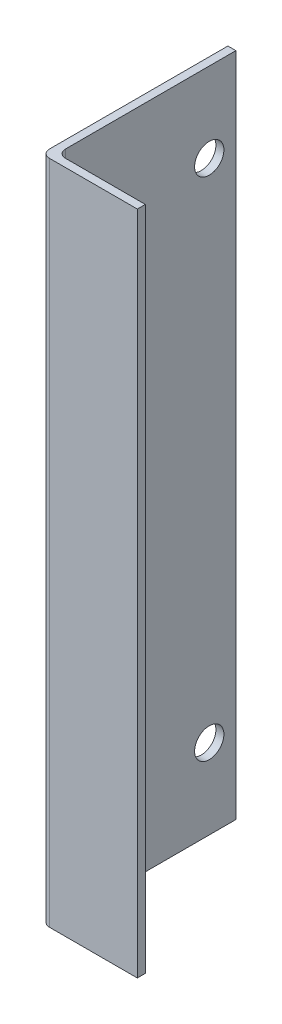
ISO-10303-21;
HEADER;
FILE_DESCRIPTION(('STEP AP214'),'2;1');
FILE_NAME('part.step','',(''),(''),'','','');
FILE_SCHEMA(('AUTOMOTIVE_DESIGN { 1 0 10303 214 1 1 1 1 }'));
ENDSEC;
DATA;
#1=APPLICATION_CONTEXT('core data for automotive mechanical design processes');
#2=APPLICATION_PROTOCOL_DEFINITION('international standard','automotive_design',2000,#1);
#3=PRODUCT_CONTEXT('',#1,'mechanical');
#4=PRODUCT('Part','Part','',(#3));
#5=PRODUCT_RELATED_PRODUCT_CATEGORY('part','',(#4));
#6=PRODUCT_DEFINITION_FORMATION('','',#4);
#7=PRODUCT_DEFINITION_CONTEXT('part definition',#1,'design');
#8=PRODUCT_DEFINITION('design','',#6,#7);
#9=PRODUCT_DEFINITION_SHAPE('','',#8);
#10=(LENGTH_UNIT() NAMED_UNIT(*) SI_UNIT(.MILLI.,.METRE.));
#11=(NAMED_UNIT(*) PLANE_ANGLE_UNIT() SI_UNIT($,.RADIAN.));
#12=(NAMED_UNIT(*) SI_UNIT($,.STERADIAN.) SOLID_ANGLE_UNIT());
#13=UNCERTAINTY_MEASURE_WITH_UNIT(LENGTH_MEASURE(1.E-05),#10,'distance_accuracy_value','');
#14=(GEOMETRIC_REPRESENTATION_CONTEXT(3) GLOBAL_UNCERTAINTY_ASSIGNED_CONTEXT((#13)) GLOBAL_UNIT_ASSIGNED_CONTEXT((#10,
#11,#12)) REPRESENTATION_CONTEXT('',''));
#15=CARTESIAN_POINT('',(0.,0.,0.));
#16=DIRECTION('',(0.,0.,1.));
#17=DIRECTION('',(1.,0.,0.));
#18=AXIS2_PLACEMENT_3D('',#15,#16,#17);
#19=CARTESIAN_POINT('',(0.,125.,0.));
#20=DIRECTION('',(0.,0.,-1.));
#21=DIRECTION('',(-1.,0.,0.));
#22=AXIS2_PLACEMENT_3D('',#19,#20,#21);
#23=PLANE('',#22);
#24=DIRECTION('',(1.,0.,0.));
#25=VECTOR('',#24,1.);
#26=CARTESIAN_POINT('',(0.,125.,0.));
#27=LINE('',#26,#25);
#28=CARTESIAN_POINT('',(1.5,125.,0.));
#29=VERTEX_POINT('',#28);
#30=CARTESIAN_POINT('',(18.,125.,0.));
#31=VERTEX_POINT('',#30);
#32=EDGE_CURVE('E104',#29,#31,#27,.T.);
#33=ORIENTED_EDGE('',*,*,#32,.F.);
#34=DIRECTION('',(0.,-1.,0.));
#35=VECTOR('',#34,1.);
#36=CARTESIAN_POINT('',(1.5,125.,0.));
#37=LINE('',#36,#35);
#38=CARTESIAN_POINT('',(1.5,0.,0.));
#39=VERTEX_POINT('',#38);
#40=EDGE_CURVE('E150',#29,#39,#37,.T.);
#41=ORIENTED_EDGE('',*,*,#40,.T.);
#42=DIRECTION('',(1.,0.,0.));
#43=VECTOR('',#42,1.);
#44=CARTESIAN_POINT('',(0.,0.,0.));
#45=LINE('',#44,#43);
#46=CARTESIAN_POINT('',(18.,0.,0.));
#47=VERTEX_POINT('',#46);
#48=EDGE_CURVE('E128',#39,#47,#45,.T.);
#49=ORIENTED_EDGE('',*,*,#48,.T.);
#50=DIRECTION('',(0.,-1.,0.));
#51=VECTOR('',#50,1.);
#52=CARTESIAN_POINT('',(18.,125.,0.));
#53=LINE('',#52,#51);
#54=EDGE_CURVE('E121',#31,#47,#53,.T.);
#55=ORIENTED_EDGE('',*,*,#54,.F.);
#56=EDGE_LOOP('',(#33,#41,#49,#55));
#57=FACE_BOUND('',#56,.T.);
#58=ADVANCED_FACE('F39',(#57),#23,.F.);
#59=CARTESIAN_POINT('',(18.,125.,-1.5));
#60=DIRECTION('',(-1.,0.,0.));
#61=DIRECTION('',(0.,0.,1.));
#62=AXIS2_PLACEMENT_3D('',#59,#60,#61);
#63=PLANE('',#62);
#64=DIRECTION('',(0.,0.,-1.));
#65=VECTOR('',#64,1.);
#66=CARTESIAN_POINT('',(18.,0.,-1.5));
#67=LINE('',#66,#65);
#68=CARTESIAN_POINT('',(18.,0.,-1.5));
#69=VERTEX_POINT('',#68);
#70=EDGE_CURVE('E158',#47,#69,#67,.T.);
#71=ORIENTED_EDGE('',*,*,#70,.T.);
#72=DIRECTION('',(0.,-1.,0.));
#73=VECTOR('',#72,1.);
#74=CARTESIAN_POINT('',(18.,125.,-1.5));
#75=LINE('',#74,#73);
#76=CARTESIAN_POINT('',(18.,125.,-1.5));
#77=VERTEX_POINT('',#76);
#78=EDGE_CURVE('E123',#77,#69,#75,.T.);
#79=ORIENTED_EDGE('',*,*,#78,.F.);
#80=DIRECTION('',(0.,0.,-1.));
#81=VECTOR('',#80,1.);
#82=CARTESIAN_POINT('',(18.,125.,-1.5));
#83=LINE('',#82,#81);
#84=EDGE_CURVE('E108',#31,#77,#83,.T.);
#85=ORIENTED_EDGE('',*,*,#84,.F.);
#86=ORIENTED_EDGE('',*,*,#54,.T.);
#87=EDGE_LOOP('',(#71,#79,#85,#86));
#88=FACE_BOUND('',#87,.T.);
#89=ADVANCED_FACE('F120',(#88),#63,.F.);
#90=CARTESIAN_POINT('',(1.5,125.,-1.5));
#91=DIRECTION('',(0.,0.,1.));
#92=DIRECTION('',(1.,0.,0.));
#93=AXIS2_PLACEMENT_3D('',#90,#91,#92);
#94=PLANE('',#93);
#95=DIRECTION('',(-1.,0.,0.));
#96=VECTOR('',#95,1.);
#97=CARTESIAN_POINT('',(1.5,0.,-1.5));
#98=LINE('',#97,#96);
#99=CARTESIAN_POINT('',(3.,0.,-1.5));
#100=VERTEX_POINT('',#99);
#101=EDGE_CURVE('E164',#69,#100,#98,.T.);
#102=ORIENTED_EDGE('',*,*,#101,.T.);
#103=DIRECTION('',(0.,-1.,0.));
#104=VECTOR('',#103,1.);
#105=CARTESIAN_POINT('',(3.,125.,-1.5));
#106=LINE('',#105,#104);
#107=CARTESIAN_POINT('',(3.,125.,-1.5));
#108=VERTEX_POINT('',#107);
#109=EDGE_CURVE('E136',#100,#108,#106,.F.);
#110=ORIENTED_EDGE('',*,*,#109,.T.);
#111=DIRECTION('',(-1.,0.,0.));
#112=VECTOR('',#111,1.);
#113=CARTESIAN_POINT('',(1.5,125.,-1.5));
#114=LINE('',#113,#112);
#115=EDGE_CURVE('E126',#77,#108,#114,.T.);
#116=ORIENTED_EDGE('',*,*,#115,.F.);
#117=ORIENTED_EDGE('',*,*,#78,.T.);
#118=EDGE_LOOP('',(#102,#110,#116,#117));
#119=FACE_BOUND('',#118,.T.);
#120=ADVANCED_FACE('F216',(#119),#94,.F.);
#121=CARTESIAN_POINT('',(1.5,125.,-35.));
#122=DIRECTION('',(-1.,0.,0.));
#123=DIRECTION('',(0.,0.,1.));
#124=AXIS2_PLACEMENT_3D('',#121,#122,#123);
#125=PLANE('',#124);
#126=CARTESIAN_POINT('',(1.5,110.,-30.));
#127=DIRECTION('',(1.,0.,0.));
#128=DIRECTION('',(0.,0.,-1.));
#129=AXIS2_PLACEMENT_3D('',#126,#127,#128);
#130=CIRCLE('',#129,2.75);
#131=CARTESIAN_POINT('',(1.5,110.,-32.75));
#132=VERTEX_POINT('',#131);
#133=EDGE_CURVE('E167',#132,#132,#130,.T.);
#134=ORIENTED_EDGE('',*,*,#133,.F.);
#135=EDGE_LOOP('',(#134));
#136=FACE_BOUND('',#135,.T.);
#137=CARTESIAN_POINT('',(1.5,15.,-30.));
#138=DIRECTION('',(1.,0.,0.));
#139=DIRECTION('',(0.,0.,-1.));
#140=AXIS2_PLACEMENT_3D('',#137,#138,#139);
#141=CIRCLE('',#140,2.75);
#142=CARTESIAN_POINT('',(1.5,15.,-32.75));
#143=VERTEX_POINT('',#142);
#144=EDGE_CURVE('E248',#143,#143,#141,.T.);
#145=ORIENTED_EDGE('',*,*,#144,.F.);
#146=EDGE_LOOP('',(#145));
#147=FACE_BOUND('',#146,.T.);
#148=DIRECTION('',(0.,0.,-1.));
#149=VECTOR('',#148,1.);
#150=CARTESIAN_POINT('',(1.5,125.,-35.));
#151=LINE('',#150,#149);
#152=CARTESIAN_POINT('',(1.5,125.,-3.));
#153=VERTEX_POINT('',#152);
#154=CARTESIAN_POINT('',(1.5,125.,-35.));
#155=VERTEX_POINT('',#154);
#156=EDGE_CURVE('E256',#153,#155,#151,.T.);
#157=ORIENTED_EDGE('',*,*,#156,.F.);
#158=DIRECTION('',(0.,-1.,0.));
#159=VECTOR('',#158,1.);
#160=CARTESIAN_POINT('',(1.5,0.,-3.));
#161=LINE('',#160,#159);
#162=CARTESIAN_POINT('',(1.5,0.,-3.));
#163=VERTEX_POINT('',#162);
#164=EDGE_CURVE('E131',#153,#163,#161,.T.);
#165=ORIENTED_EDGE('',*,*,#164,.T.);
#166=DIRECTION('',(0.,0.,-1.));
#167=VECTOR('',#166,1.);
#168=CARTESIAN_POINT('',(1.5,0.,-35.));
#169=LINE('',#168,#167);
#170=CARTESIAN_POINT('',(1.5,0.,-35.));
#171=VERTEX_POINT('',#170);
#172=EDGE_CURVE('E176',#163,#171,#169,.T.);
#173=ORIENTED_EDGE('',*,*,#172,.T.);
#174=DIRECTION('',(0.,-1.,0.));
#175=VECTOR('',#174,1.);
#176=CARTESIAN_POINT('',(1.5,125.,-35.));
#177=LINE('',#176,#175);
#178=EDGE_CURVE('E138',#155,#171,#177,.T.);
#179=ORIENTED_EDGE('',*,*,#178,.F.);
#180=EDGE_LOOP('',(#157,#165,#173,#179));
#181=FACE_BOUND('',#180,.T.);
#182=ADVANCED_FACE('F221',(#136,#147,#181),#125,.F.);
#183=CARTESIAN_POINT('',(0.,125.,-35.));
#184=DIRECTION('',(0.,0.,1.));
#185=DIRECTION('',(1.,0.,0.));
#186=AXIS2_PLACEMENT_3D('',#183,#184,#185);
#187=PLANE('',#186);
#188=DIRECTION('',(-1.,0.,0.));
#189=VECTOR('',#188,1.);
#190=CARTESIAN_POINT('',(0.,0.,-35.));
#191=LINE('',#190,#189);
#192=CARTESIAN_POINT('',(0.,0.,-35.));
#193=VERTEX_POINT('',#192);
#194=EDGE_CURVE('E179',#171,#193,#191,.T.);
#195=ORIENTED_EDGE('',*,*,#194,.T.);
#196=DIRECTION('',(0.,-1.,0.));
#197=VECTOR('',#196,1.);
#198=CARTESIAN_POINT('',(0.,125.,-35.));
#199=LINE('',#198,#197);
#200=CARTESIAN_POINT('',(0.,125.,-35.));
#201=VERTEX_POINT('',#200);
#202=EDGE_CURVE('E184',#201,#193,#199,.T.);
#203=ORIENTED_EDGE('',*,*,#202,.F.);
#204=DIRECTION('',(-1.,0.,0.));
#205=VECTOR('',#204,1.);
#206=CARTESIAN_POINT('',(0.,125.,-35.));
#207=LINE('',#206,#205);
#208=EDGE_CURVE('E195',#155,#201,#207,.T.);
#209=ORIENTED_EDGE('',*,*,#208,.F.);
#210=ORIENTED_EDGE('',*,*,#178,.T.);
#211=EDGE_LOOP('',(#195,#203,#209,#210));
#212=FACE_BOUND('',#211,.T.);
#213=ADVANCED_FACE('F193',(#212),#187,.F.);
#214=CARTESIAN_POINT('',(0.,125.,0.));
#215=DIRECTION('',(1.,0.,0.));
#216=DIRECTION('',(0.,0.,-1.));
#217=AXIS2_PLACEMENT_3D('',#214,#215,#216);
#218=PLANE('',#217);
#219=CARTESIAN_POINT('',(0.,110.,-30.));
#220=DIRECTION('',(1.,0.,0.));
#221=DIRECTION('',(0.,0.,-1.));
#222=AXIS2_PLACEMENT_3D('',#219,#220,#221);
#223=CIRCLE('',#222,2.75);
#224=CARTESIAN_POINT('',(0.,110.,-32.75));
#225=VERTEX_POINT('',#224);
#226=EDGE_CURVE('E160',#225,#225,#223,.T.);
#227=ORIENTED_EDGE('',*,*,#226,.T.);
#228=EDGE_LOOP('',(#227));
#229=FACE_BOUND('',#228,.T.);
#230=CARTESIAN_POINT('',(0.,15.,-30.));
#231=DIRECTION('',(1.,0.,0.));
#232=DIRECTION('',(0.,0.,-1.));
#233=AXIS2_PLACEMENT_3D('',#230,#231,#232);
#234=CIRCLE('',#233,2.75);
#235=CARTESIAN_POINT('',(0.,15.,-32.75));
#236=VERTEX_POINT('',#235);
#237=EDGE_CURVE('E244',#236,#236,#234,.T.);
#238=ORIENTED_EDGE('',*,*,#237,.T.);
#239=EDGE_LOOP('',(#238));
#240=FACE_BOUND('',#239,.T.);
#241=DIRECTION('',(0.,0.,1.));
#242=VECTOR('',#241,1.);
#243=CARTESIAN_POINT('',(0.,0.,0.));
#244=LINE('',#243,#242);
#245=CARTESIAN_POINT('',(0.,0.,-1.5));
#246=VERTEX_POINT('',#245);
#247=EDGE_CURVE('E116',#193,#246,#244,.T.);
#248=ORIENTED_EDGE('',*,*,#247,.T.);
#249=DIRECTION('',(0.,-1.,0.));
#250=VECTOR('',#249,1.);
#251=CARTESIAN_POINT('',(0.,125.,-1.5));
#252=LINE('',#251,#250);
#253=CARTESIAN_POINT('',(0.,125.,-1.5));
#254=VERTEX_POINT('',#253);
#255=EDGE_CURVE('E48',#246,#254,#252,.F.);
#256=ORIENTED_EDGE('',*,*,#255,.T.);
#257=DIRECTION('',(0.,0.,1.));
#258=VECTOR('',#257,1.);
#259=CARTESIAN_POINT('',(0.,125.,0.));
#260=LINE('',#259,#258);
#261=EDGE_CURVE('E170',#201,#254,#260,.T.);
#262=ORIENTED_EDGE('',*,*,#261,.F.);
#263=ORIENTED_EDGE('',*,*,#202,.T.);
#264=EDGE_LOOP('',(#248,#256,#262,#263));
#265=FACE_BOUND('',#264,.T.);
#266=ADVANCED_FACE('F199',(#229,#240,#265),#218,.F.);
#267=CARTESIAN_POINT('',(0.,125.,0.));
#268=DIRECTION('',(0.,-1.,0.));
#269=DIRECTION('',(0.,0.,-1.));
#270=AXIS2_PLACEMENT_3D('',#267,#268,#269);
#271=PLANE('',#270);
#272=ORIENTED_EDGE('',*,*,#261,.T.);
#273=CARTESIAN_POINT('',(1.5,125.,-1.5));
#274=DIRECTION('',(0.,-1.,0.));
#275=DIRECTION('',(0.,0.,-1.));
#276=AXIS2_PLACEMENT_3D('',#273,#274,#275);
#277=CIRCLE('',#276,1.5);
#278=EDGE_CURVE('E11',#254,#29,#277,.F.);
#279=ORIENTED_EDGE('',*,*,#278,.T.);
#280=ORIENTED_EDGE('',*,*,#32,.T.);
#281=ORIENTED_EDGE('',*,*,#84,.T.);
#282=ORIENTED_EDGE('',*,*,#115,.T.);
#283=CARTESIAN_POINT('',(3.,125.,-3.));
#284=DIRECTION('',(0.,-1.,0.));
#285=DIRECTION('',(0.,0.,-1.));
#286=AXIS2_PLACEMENT_3D('',#283,#284,#285);
#287=CIRCLE('',#286,1.5);
#288=EDGE_CURVE('E147',#108,#153,#287,.T.);
#289=ORIENTED_EDGE('',*,*,#288,.T.);
#290=ORIENTED_EDGE('',*,*,#156,.T.);
#291=ORIENTED_EDGE('',*,*,#208,.T.);
#292=EDGE_LOOP('',(#272,#279,#280,#281,#282,#289,#290,#291));
#293=FACE_BOUND('',#292,.T.);
#294=ADVANCED_FACE('F106',(#293),#271,.F.);
#295=CARTESIAN_POINT('',(0.,0.,0.));
#296=DIRECTION('',(0.,-1.,0.));
#297=DIRECTION('',(0.,0.,-1.));
#298=AXIS2_PLACEMENT_3D('',#295,#296,#297);
#299=PLANE('',#298);
#300=ORIENTED_EDGE('',*,*,#48,.F.);
#301=CARTESIAN_POINT('',(1.5,0.,-1.5));
#302=DIRECTION('',(0.,-1.,0.));
#303=DIRECTION('',(0.,0.,-1.));
#304=AXIS2_PLACEMENT_3D('',#301,#302,#303);
#305=CIRCLE('',#304,1.5);
#306=EDGE_CURVE('E62',#39,#246,#305,.T.);
#307=ORIENTED_EDGE('',*,*,#306,.T.);
#308=ORIENTED_EDGE('',*,*,#247,.F.);
#309=ORIENTED_EDGE('',*,*,#194,.F.);
#310=ORIENTED_EDGE('',*,*,#172,.F.);
#311=CARTESIAN_POINT('',(3.,0.,-3.));
#312=DIRECTION('',(0.,-1.,0.));
#313=DIRECTION('',(0.,0.,-1.));
#314=AXIS2_PLACEMENT_3D('',#311,#312,#313);
#315=CIRCLE('',#314,1.5);
#316=EDGE_CURVE('E144',#163,#100,#315,.F.);
#317=ORIENTED_EDGE('',*,*,#316,.T.);
#318=ORIENTED_EDGE('',*,*,#101,.F.);
#319=ORIENTED_EDGE('',*,*,#70,.F.);
#320=EDGE_LOOP('',(#300,#307,#308,#309,#310,#317,#318,#319));
#321=FACE_BOUND('',#320,.T.);
#322=ADVANCED_FACE('F156',(#321),#299,.T.);
#323=CARTESIAN_POINT('',(3.,125.,-3.));
#324=DIRECTION('',(0.,1.,0.));
#325=DIRECTION('',(0.,0.,1.));
#326=AXIS2_PLACEMENT_3D('',#323,#324,#325);
#327=CYLINDRICAL_SURFACE('',#326,1.5);
#328=ORIENTED_EDGE('',*,*,#288,.F.);
#329=ORIENTED_EDGE('',*,*,#109,.F.);
#330=ORIENTED_EDGE('',*,*,#316,.F.);
#331=ORIENTED_EDGE('',*,*,#164,.F.);
#332=EDGE_LOOP('',(#328,#329,#330,#331));
#333=FACE_BOUND('',#332,.T.);
#334=ADVANCED_FACE('F202',(#333),#327,.F.);
#335=CARTESIAN_POINT('',(1.5,125.,-1.5));
#336=DIRECTION('',(0.,-1.,0.));
#337=DIRECTION('',(0.,0.,-1.));
#338=AXIS2_PLACEMENT_3D('',#335,#336,#337);
#339=CYLINDRICAL_SURFACE('',#338,1.5);
#340=ORIENTED_EDGE('',*,*,#278,.F.);
#341=ORIENTED_EDGE('',*,*,#255,.F.);
#342=ORIENTED_EDGE('',*,*,#306,.F.);
#343=ORIENTED_EDGE('',*,*,#40,.F.);
#344=EDGE_LOOP('',(#340,#341,#342,#343));
#345=FACE_BOUND('',#344,.T.);
#346=ADVANCED_FACE('F41',(#345),#339,.T.);
#347=CARTESIAN_POINT('',(0.,15.,-30.));
#348=DIRECTION('',(1.,0.,0.));
#349=DIRECTION('',(0.,0.,-1.));
#350=AXIS2_PLACEMENT_3D('',#347,#348,#349);
#351=CYLINDRICAL_SURFACE('',#350,2.75);
#352=ORIENTED_EDGE('',*,*,#237,.F.);
#353=EDGE_LOOP('',(#352));
#354=FACE_BOUND('',#353,.T.);
#355=ORIENTED_EDGE('',*,*,#144,.T.);
#356=EDGE_LOOP('',(#355));
#357=FACE_BOUND('',#356,.T.);
#358=ADVANCED_FACE('F201',(#354,#357),#351,.F.);
#359=CARTESIAN_POINT('',(0.,110.,-30.));
#360=DIRECTION('',(1.,0.,0.));
#361=DIRECTION('',(0.,0.,-1.));
#362=AXIS2_PLACEMENT_3D('',#359,#360,#361);
#363=CYLINDRICAL_SURFACE('',#362,2.75);
#364=ORIENTED_EDGE('',*,*,#226,.F.);
#365=EDGE_LOOP('',(#364));
#366=FACE_BOUND('',#365,.T.);
#367=ORIENTED_EDGE('',*,*,#133,.T.);
#368=EDGE_LOOP('',(#367));
#369=FACE_BOUND('',#368,.T.);
#370=ADVANCED_FACE('F207',(#366,#369),#363,.F.);
#371=CLOSED_SHELL('',(#58,#89,#120,#182,#213,#266,#294,#322,#334,#346,#358,#370));
#372=MANIFOLD_SOLID_BREP('B2',#371);
#373=ADVANCED_BREP_SHAPE_REPRESENTATION('',(#18,#372),#14);
#374=SHAPE_DEFINITION_REPRESENTATION(#9,#373);
ENDSEC;
END-ISO-10303-21;
